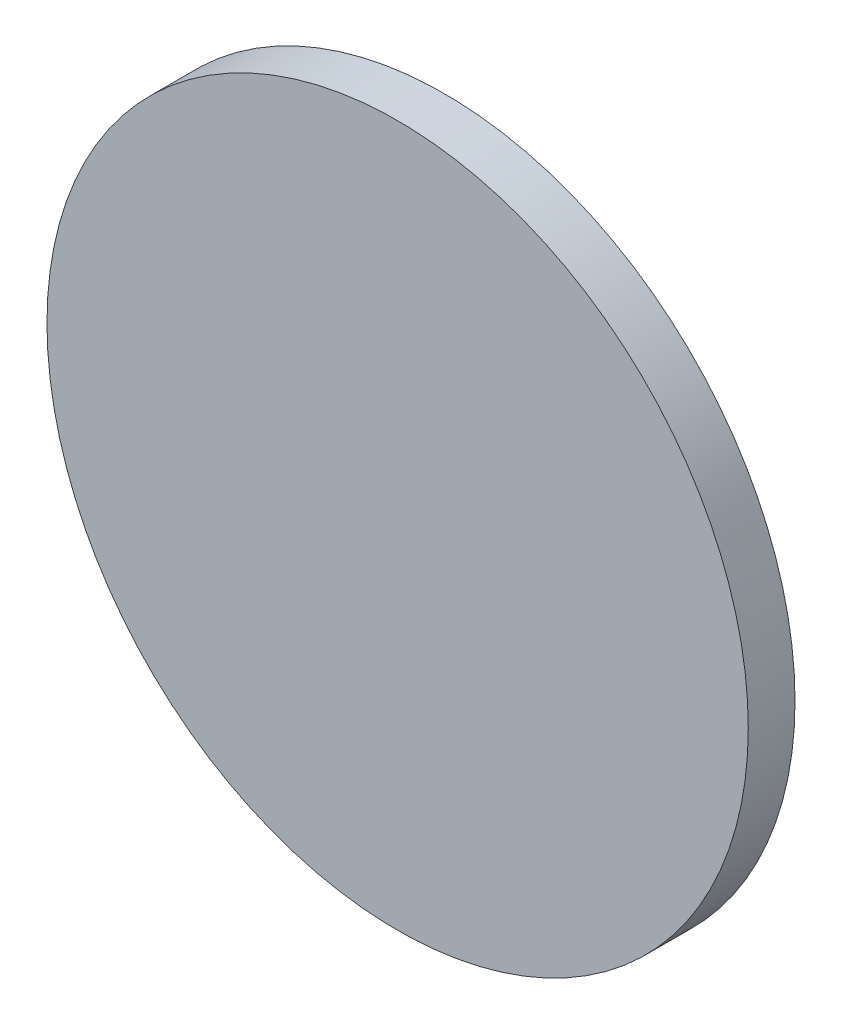
ISO-10303-21;
HEADER;
FILE_DESCRIPTION(('STEP AP214'),'2;1');
FILE_NAME('part.step','',(''),(''),'','','');
FILE_SCHEMA(('AUTOMOTIVE_DESIGN { 1 0 10303 214 1 1 1 1 }'));
ENDSEC;
DATA;
#1=APPLICATION_CONTEXT('core data for automotive mechanical design processes');
#2=APPLICATION_PROTOCOL_DEFINITION('international standard','automotive_design',2000,#1);
#3=PRODUCT_CONTEXT('',#1,'mechanical');
#4=PRODUCT('Part','Part','',(#3));
#5=PRODUCT_RELATED_PRODUCT_CATEGORY('part','',(#4));
#6=PRODUCT_DEFINITION_FORMATION('','',#4);
#7=PRODUCT_DEFINITION_CONTEXT('part definition',#1,'design');
#8=PRODUCT_DEFINITION('design','',#6,#7);
#9=PRODUCT_DEFINITION_SHAPE('','',#8);
#10=(LENGTH_UNIT() NAMED_UNIT(*) SI_UNIT(.MILLI.,.METRE.));
#11=(NAMED_UNIT(*) PLANE_ANGLE_UNIT() SI_UNIT($,.RADIAN.));
#12=(NAMED_UNIT(*) SI_UNIT($,.STERADIAN.) SOLID_ANGLE_UNIT());
#13=UNCERTAINTY_MEASURE_WITH_UNIT(LENGTH_MEASURE(1.E-05),#10,'distance_accuracy_value','');
#14=(GEOMETRIC_REPRESENTATION_CONTEXT(3) GLOBAL_UNCERTAINTY_ASSIGNED_CONTEXT((#13)) GLOBAL_UNIT_ASSIGNED_CONTEXT((#10,
#11,#12)) REPRESENTATION_CONTEXT('',''));
#15=CARTESIAN_POINT('',(0.,0.,0.));
#16=DIRECTION('',(0.,0.,1.));
#17=DIRECTION('',(1.,0.,0.));
#18=AXIS2_PLACEMENT_3D('',#15,#16,#17);
#19=CARTESIAN_POINT('',(475.,-275.,2.));
#20=DIRECTION('',(0.,0.,-1.));
#21=DIRECTION('',(-1.,0.,0.));
#22=AXIS2_PLACEMENT_3D('',#19,#20,#21);
#23=CYLINDRICAL_SURFACE('',#22,15.);
#24=CARTESIAN_POINT('',(475.,-275.,2.));
#25=DIRECTION('',(0.,0.,1.));
#26=DIRECTION('',(1.,0.,0.));
#27=AXIS2_PLACEMENT_3D('',#24,#25,#26);
#28=CIRCLE('',#27,15.);
#29=CARTESIAN_POINT('',(490.,-275.,2.));
#30=VERTEX_POINT('',#29);
#31=EDGE_CURVE('E10',#30,#30,#28,.T.);
#32=ORIENTED_EDGE('',*,*,#31,.F.);
#33=EDGE_LOOP('',(#32));
#34=FACE_BOUND('',#33,.T.);
#35=CARTESIAN_POINT('',(475.,-275.,0.));
#36=DIRECTION('',(0.,0.,1.));
#37=DIRECTION('',(1.,0.,0.));
#38=AXIS2_PLACEMENT_3D('',#35,#36,#37);
#39=CIRCLE('',#38,15.);
#40=CARTESIAN_POINT('',(490.,-275.,0.));
#41=VERTEX_POINT('',#40);
#42=EDGE_CURVE('E33',#41,#41,#39,.T.);
#43=ORIENTED_EDGE('',*,*,#42,.T.);
#44=EDGE_LOOP('',(#43));
#45=FACE_BOUND('',#44,.T.);
#46=ADVANCED_FACE('F30',(#34,#45),#23,.T.);
#47=CARTESIAN_POINT('',(475.,-275.,2.));
#48=DIRECTION('',(0.,0.,1.));
#49=DIRECTION('',(1.,0.,0.));
#50=AXIS2_PLACEMENT_3D('',#47,#48,#49);
#51=PLANE('',#50);
#52=ORIENTED_EDGE('',*,*,#31,.T.);
#53=EDGE_LOOP('',(#52));
#54=FACE_BOUND('',#53,.T.);
#55=ADVANCED_FACE('F45',(#54),#51,.T.);
#56=CARTESIAN_POINT('',(475.,-275.,0.));
#57=DIRECTION('',(0.,0.,1.));
#58=DIRECTION('',(1.,0.,0.));
#59=AXIS2_PLACEMENT_3D('',#56,#57,#58);
#60=PLANE('',#59);
#61=ORIENTED_EDGE('',*,*,#42,.F.);
#62=EDGE_LOOP('',(#61));
#63=FACE_BOUND('',#62,.T.);
#64=ADVANCED_FACE('F43',(#63),#60,.F.);
#65=CLOSED_SHELL('',(#46,#55,#64));
#66=MANIFOLD_SOLID_BREP('B2',#65);
#67=ADVANCED_BREP_SHAPE_REPRESENTATION('',(#18,#66),#14);
#68=SHAPE_DEFINITION_REPRESENTATION(#9,#67);
ENDSEC;
END-ISO-10303-21;
